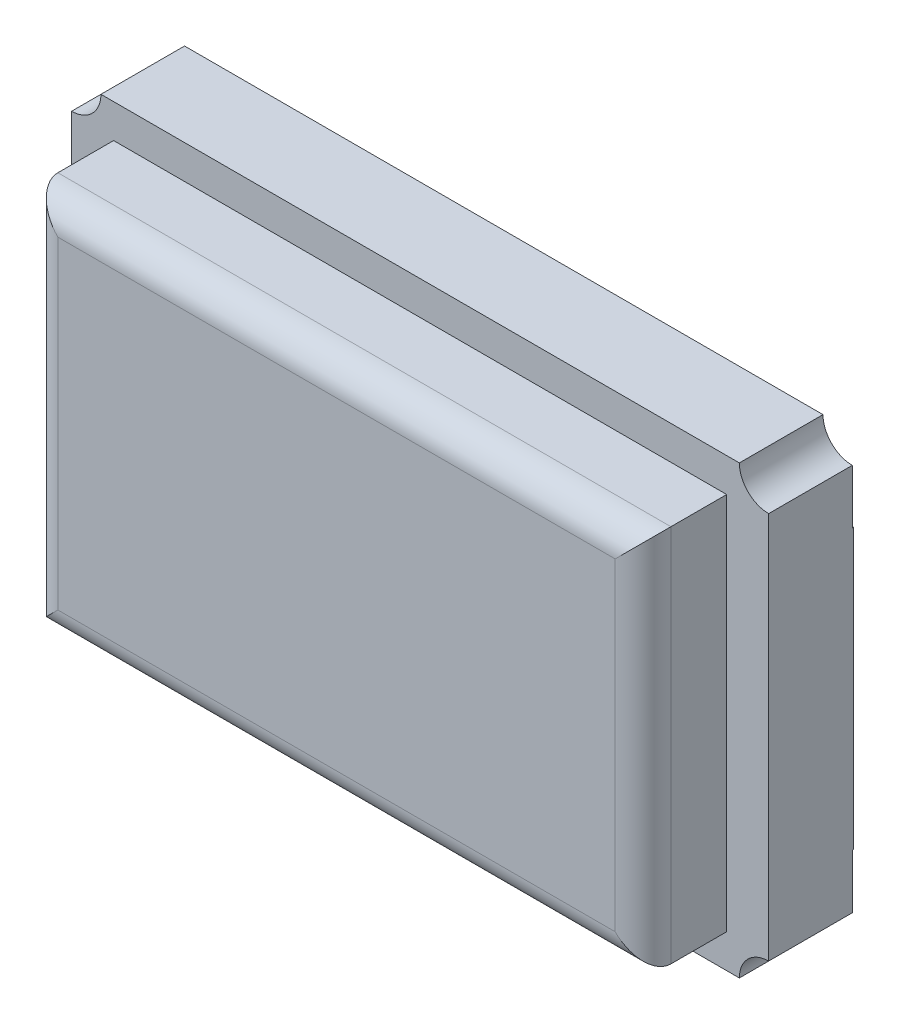
ISO-10303-21;
HEADER;
FILE_DESCRIPTION(('STEP AP214'),'2;1');
FILE_NAME('part.step','',(''),(''),'','','');
FILE_SCHEMA(('AUTOMOTIVE_DESIGN { 1 0 10303 214 1 1 1 1 }'));
ENDSEC;
DATA;
#1=APPLICATION_CONTEXT('core data for automotive mechanical design processes');
#2=APPLICATION_PROTOCOL_DEFINITION('international standard','automotive_design',2000,#1);
#3=PRODUCT_CONTEXT('',#1,'mechanical');
#4=PRODUCT('Part','Part','',(#3));
#5=PRODUCT_RELATED_PRODUCT_CATEGORY('part','',(#4));
#6=PRODUCT_DEFINITION_FORMATION('','',#4);
#7=PRODUCT_DEFINITION_CONTEXT('part definition',#1,'design');
#8=PRODUCT_DEFINITION('design','',#6,#7);
#9=PRODUCT_DEFINITION_SHAPE('','',#8);
#10=(LENGTH_UNIT() NAMED_UNIT(*) SI_UNIT(.MILLI.,.METRE.));
#11=(NAMED_UNIT(*) PLANE_ANGLE_UNIT() SI_UNIT($,.RADIAN.));
#12=(NAMED_UNIT(*) SI_UNIT($,.STERADIAN.) SOLID_ANGLE_UNIT());
#13=UNCERTAINTY_MEASURE_WITH_UNIT(LENGTH_MEASURE(1.E-05),#10,'distance_accuracy_value','');
#14=(GEOMETRIC_REPRESENTATION_CONTEXT(3) GLOBAL_UNCERTAINTY_ASSIGNED_CONTEXT((#13)) GLOBAL_UNIT_ASSIGNED_CONTEXT((#10,
#11,#12)) REPRESENTATION_CONTEXT('',''));
#15=CARTESIAN_POINT('',(0.,0.,0.));
#16=DIRECTION('',(0.,0.,1.));
#17=DIRECTION('',(1.,0.,0.));
#18=AXIS2_PLACEMENT_3D('',#15,#16,#17);
#19=CARTESIAN_POINT('',(-2.5,1.6,0.));
#20=DIRECTION('',(0.,0.,1.));
#21=DIRECTION('',(1.,0.,0.));
#22=AXIS2_PLACEMENT_3D('',#19,#20,#21);
#23=PLANE('',#22);
#24=DIRECTION('',(1.,0.,0.));
#25=VECTOR('',#24,1.);
#26=CARTESIAN_POINT('',(-2.5,0.999999999999999,0.));
#27=LINE('',#26,#25);
#28=CARTESIAN_POINT('',(-2.5,0.999999999999999,0.));
#29=VERTEX_POINT('',#28);
#30=CARTESIAN_POINT('',(-1.4,1.,0.));
#31=VERTEX_POINT('',#30);
#32=EDGE_CURVE('E216',#29,#31,#27,.T.);
#33=ORIENTED_EDGE('',*,*,#32,.F.);
#34=DIRECTION('',(0.,-1.,0.));
#35=VECTOR('',#34,1.);
#36=CARTESIAN_POINT('',(-2.5,1.38992371218339,0.));
#37=LINE('',#36,#35);
#38=CARTESIAN_POINT('',(-2.5,1.38992371218339,0.));
#39=VERTEX_POINT('',#38);
#40=EDGE_CURVE('E326',#39,#29,#37,.T.);
#41=ORIENTED_EDGE('',*,*,#40,.F.);
#42=CARTESIAN_POINT('',(-2.5,1.6,0.));
#43=DIRECTION('',(0.,0.,-1.));
#44=DIRECTION('',(1.,0.,0.));
#45=AXIS2_PLACEMENT_3D('',#42,#43,#44);
#46=CIRCLE('',#45,0.21007628781661);
#47=CARTESIAN_POINT('',(-2.28992371218339,1.6,0.));
#48=VERTEX_POINT('',#47);
#49=EDGE_CURVE('E294',#48,#39,#46,.T.);
#50=ORIENTED_EDGE('',*,*,#49,.F.);
#51=DIRECTION('',(-1.,0.,0.));
#52=VECTOR('',#51,1.);
#53=CARTESIAN_POINT('',(-2.28992371218339,1.6,0.));
#54=LINE('',#53,#52);
#55=CARTESIAN_POINT('',(2.28992371218339,1.6,0.));
#56=VERTEX_POINT('',#55);
#57=EDGE_CURVE('E300',#56,#48,#54,.T.);
#58=ORIENTED_EDGE('',*,*,#57,.F.);
#59=CARTESIAN_POINT('',(2.5,1.6,0.));
#60=DIRECTION('',(0.,0.,-1.));
#61=DIRECTION('',(-1.,0.,0.));
#62=AXIS2_PLACEMENT_3D('',#59,#60,#61);
#63=CIRCLE('',#62,0.21007628781661);
#64=CARTESIAN_POINT('',(2.5,1.38992371218339,0.));
#65=VERTEX_POINT('',#64);
#66=EDGE_CURVE('E344',#65,#56,#63,.T.);
#67=ORIENTED_EDGE('',*,*,#66,.F.);
#68=DIRECTION('',(0.,1.,0.));
#69=VECTOR('',#68,1.);
#70=CARTESIAN_POINT('',(2.5,1.38992371218339,0.));
#71=LINE('',#70,#69);
#72=CARTESIAN_POINT('',(2.5,1.,0.));
#73=VERTEX_POINT('',#72);
#74=EDGE_CURVE('E339',#73,#65,#71,.T.);
#75=ORIENTED_EDGE('',*,*,#74,.F.);
#76=DIRECTION('',(1.,0.,0.));
#77=VECTOR('',#76,1.);
#78=CARTESIAN_POINT('',(2.5,1.,0.));
#79=LINE('',#78,#77);
#80=CARTESIAN_POINT('',(1.4,1.,0.));
#81=VERTEX_POINT('',#80);
#82=EDGE_CURVE('E235',#81,#73,#79,.T.);
#83=ORIENTED_EDGE('',*,*,#82,.F.);
#84=DIRECTION('',(0.,1.,0.));
#85=VECTOR('',#84,1.);
#86=CARTESIAN_POINT('',(1.4,1.,0.));
#87=LINE('',#86,#85);
#88=CARTESIAN_POINT('',(1.4,-1.,0.));
#89=VERTEX_POINT('',#88);
#90=EDGE_CURVE('E224',#89,#81,#87,.T.);
#91=ORIENTED_EDGE('',*,*,#90,.F.);
#92=DIRECTION('',(-1.,0.,0.));
#93=VECTOR('',#92,1.);
#94=CARTESIAN_POINT('',(2.5,-1.,0.));
#95=LINE('',#94,#93);
#96=CARTESIAN_POINT('',(2.5,-1.,0.));
#97=VERTEX_POINT('',#96);
#98=EDGE_CURVE('E219',#97,#89,#95,.T.);
#99=ORIENTED_EDGE('',*,*,#98,.F.);
#100=CARTESIAN_POINT('',(2.5,-1.38992371218339,0.));
#101=VERTEX_POINT('',#100);
#102=EDGE_CURVE('E340',#101,#97,#71,.T.);
#103=ORIENTED_EDGE('',*,*,#102,.F.);
#104=CARTESIAN_POINT('',(2.5,-1.6,0.));
#105=DIRECTION('',(0.,0.,-1.));
#106=DIRECTION('',(1.,0.,0.));
#107=AXIS2_PLACEMENT_3D('',#104,#105,#106);
#108=CIRCLE('',#107,0.210076287816611);
#109=CARTESIAN_POINT('',(2.28992371218339,-1.6,0.));
#110=VERTEX_POINT('',#109);
#111=EDGE_CURVE('E336',#110,#101,#108,.T.);
#112=ORIENTED_EDGE('',*,*,#111,.F.);
#113=DIRECTION('',(1.,0.,0.));
#114=VECTOR('',#113,1.);
#115=CARTESIAN_POINT('',(-2.28992371218339,-1.6,0.));
#116=LINE('',#115,#114);
#117=CARTESIAN_POINT('',(-2.28992371218339,-1.6,0.));
#118=VERTEX_POINT('',#117);
#119=EDGE_CURVE('E333',#118,#110,#116,.T.);
#120=ORIENTED_EDGE('',*,*,#119,.F.);
#121=CARTESIAN_POINT('',(-2.5,-1.6,0.));
#122=DIRECTION('',(0.,0.,-1.));
#123=DIRECTION('',(-1.,0.,0.));
#124=AXIS2_PLACEMENT_3D('',#121,#122,#123);
#125=CIRCLE('',#124,0.210076287816611);
#126=CARTESIAN_POINT('',(-2.5,-1.38992371218339,0.));
#127=VERTEX_POINT('',#126);
#128=EDGE_CURVE('E330',#127,#118,#125,.T.);
#129=ORIENTED_EDGE('',*,*,#128,.F.);
#130=CARTESIAN_POINT('',(-2.5,-1.,0.));
#131=VERTEX_POINT('',#130);
#132=EDGE_CURVE('E325',#131,#127,#37,.T.);
#133=ORIENTED_EDGE('',*,*,#132,.F.);
#134=DIRECTION('',(-1.,0.,0.));
#135=VECTOR('',#134,1.);
#136=CARTESIAN_POINT('',(-2.5,-1.,0.));
#137=LINE('',#136,#135);
#138=CARTESIAN_POINT('',(-1.4,-1.,0.));
#139=VERTEX_POINT('',#138);
#140=EDGE_CURVE('E212',#139,#131,#137,.T.);
#141=ORIENTED_EDGE('',*,*,#140,.F.);
#142=DIRECTION('',(0.,-1.,0.));
#143=VECTOR('',#142,1.);
#144=CARTESIAN_POINT('',(-1.4,1.,0.));
#145=LINE('',#144,#143);
#146=EDGE_CURVE('E419',#31,#139,#145,.T.);
#147=ORIENTED_EDGE('',*,*,#146,.F.);
#148=EDGE_LOOP('',(#33,#41,#50,#58,#67,#75,#83,#91,#99,#103,#112,#120,#129,#133,#141,#147));
#149=FACE_BOUND('',#148,.T.);
#150=ADVANCED_FACE('F41',(#149),#23,.F.);
#151=CARTESIAN_POINT('',(-2.5,1.6,0.6));
#152=DIRECTION('',(0.,0.,-1.));
#153=DIRECTION('',(-1.,0.,0.));
#154=AXIS2_PLACEMENT_3D('',#151,#152,#153);
#155=CYLINDRICAL_SURFACE('',#154,0.21007628781661);
#156=ORIENTED_EDGE('',*,*,#49,.T.);
#157=DIRECTION('',(0.,0.,-1.));
#158=VECTOR('',#157,1.);
#159=CARTESIAN_POINT('',(-2.5,1.38992371218339,0.6));
#160=LINE('',#159,#158);
#161=CARTESIAN_POINT('',(-2.5,1.38992371218339,0.6));
#162=VERTEX_POINT('',#161);
#163=EDGE_CURVE('E376',#162,#39,#160,.T.);
#164=ORIENTED_EDGE('',*,*,#163,.F.);
#165=CARTESIAN_POINT('',(-2.5,1.6,0.6));
#166=DIRECTION('',(0.,0.,-1.));
#167=DIRECTION('',(1.,0.,0.));
#168=AXIS2_PLACEMENT_3D('',#165,#166,#167);
#169=CIRCLE('',#168,0.21007628781661);
#170=CARTESIAN_POINT('',(-2.28992371218339,1.6,0.6));
#171=VERTEX_POINT('',#170);
#172=EDGE_CURVE('E295',#171,#162,#169,.T.);
#173=ORIENTED_EDGE('',*,*,#172,.F.);
#174=DIRECTION('',(0.,0.,-1.));
#175=VECTOR('',#174,1.);
#176=CARTESIAN_POINT('',(-2.28992371218339,1.6,0.6));
#177=LINE('',#176,#175);
#178=EDGE_CURVE('E321',#171,#48,#177,.T.);
#179=ORIENTED_EDGE('',*,*,#178,.T.);
#180=EDGE_LOOP('',(#156,#164,#173,#179));
#181=FACE_BOUND('',#180,.T.);
#182=ADVANCED_FACE('F464',(#181),#155,.F.);
#183=CARTESIAN_POINT('',(-2.5,1.38992371218339,0.6));
#184=DIRECTION('',(1.,0.,0.));
#185=DIRECTION('',(0.,0.,-1.));
#186=AXIS2_PLACEMENT_3D('',#183,#184,#185);
#187=PLANE('',#186);
#188=ORIENTED_EDGE('',*,*,#40,.T.);
#189=DIRECTION('',(0.,0.,1.));
#190=VECTOR('',#189,1.);
#191=CARTESIAN_POINT('',(-2.5,0.999999999999999,-0.01));
#192=LINE('',#191,#190);
#193=CARTESIAN_POINT('',(-2.5,0.999999999999999,-0.01));
#194=VERTEX_POINT('',#193);
#195=EDGE_CURVE('E429',#194,#29,#192,.T.);
#196=ORIENTED_EDGE('',*,*,#195,.F.);
#197=DIRECTION('',(0.,1.,0.));
#198=VECTOR('',#197,1.);
#199=CARTESIAN_POINT('',(-2.5,0.999999999999999,-0.01));
#200=LINE('',#199,#198);
#201=CARTESIAN_POINT('',(-2.5,-1.,-0.01));
#202=VERTEX_POINT('',#201);
#203=EDGE_CURVE('E208',#202,#194,#200,.T.);
#204=ORIENTED_EDGE('',*,*,#203,.F.);
#205=DIRECTION('',(0.,0.,1.));
#206=VECTOR('',#205,1.);
#207=CARTESIAN_POINT('',(-2.5,-1.,-0.01));
#208=LINE('',#207,#206);
#209=EDGE_CURVE('E226',#202,#131,#208,.T.);
#210=ORIENTED_EDGE('',*,*,#209,.T.);
#211=ORIENTED_EDGE('',*,*,#132,.T.);
#212=DIRECTION('',(0.,0.,-1.));
#213=VECTOR('',#212,1.);
#214=CARTESIAN_POINT('',(-2.5,-1.38992371218339,0.6));
#215=LINE('',#214,#213);
#216=CARTESIAN_POINT('',(-2.5,-1.38992371218339,0.6));
#217=VERTEX_POINT('',#216);
#218=EDGE_CURVE('E372',#217,#127,#215,.T.);
#219=ORIENTED_EDGE('',*,*,#218,.F.);
#220=DIRECTION('',(0.,-1.,0.));
#221=VECTOR('',#220,1.);
#222=CARTESIAN_POINT('',(-2.5,1.38992371218339,0.6));
#223=LINE('',#222,#221);
#224=EDGE_CURVE('E299',#162,#217,#223,.T.);
#225=ORIENTED_EDGE('',*,*,#224,.F.);
#226=ORIENTED_EDGE('',*,*,#163,.T.);
#227=EDGE_LOOP('',(#188,#196,#204,#210,#211,#219,#225,#226));
#228=FACE_BOUND('',#227,.T.);
#229=ADVANCED_FACE('F434',(#228),#187,.F.);
#230=CARTESIAN_POINT('',(-2.5,-1.6,0.6));
#231=DIRECTION('',(0.,0.,-1.));
#232=DIRECTION('',(-1.,0.,0.));
#233=AXIS2_PLACEMENT_3D('',#230,#231,#232);
#234=CYLINDRICAL_SURFACE('',#233,0.210076287816611);
#235=ORIENTED_EDGE('',*,*,#128,.T.);
#236=DIRECTION('',(0.,0.,-1.));
#237=VECTOR('',#236,1.);
#238=CARTESIAN_POINT('',(-2.28992371218339,-1.6,0.6));
#239=LINE('',#238,#237);
#240=CARTESIAN_POINT('',(-2.28992371218339,-1.6,0.6));
#241=VERTEX_POINT('',#240);
#242=EDGE_CURVE('E368',#241,#118,#239,.T.);
#243=ORIENTED_EDGE('',*,*,#242,.F.);
#244=CARTESIAN_POINT('',(-2.5,-1.6,0.6));
#245=DIRECTION('',(0.,0.,-1.));
#246=DIRECTION('',(-1.,0.,0.));
#247=AXIS2_PLACEMENT_3D('',#244,#245,#246);
#248=CIRCLE('',#247,0.210076287816611);
#249=EDGE_CURVE('E303',#217,#241,#248,.T.);
#250=ORIENTED_EDGE('',*,*,#249,.F.);
#251=ORIENTED_EDGE('',*,*,#218,.T.);
#252=EDGE_LOOP('',(#235,#243,#250,#251));
#253=FACE_BOUND('',#252,.T.);
#254=ADVANCED_FACE('F515',(#253),#234,.F.);
#255=CARTESIAN_POINT('',(-2.28992371218339,-1.6,0.6));
#256=DIRECTION('',(0.,1.,0.));
#257=DIRECTION('',(0.,0.,1.));
#258=AXIS2_PLACEMENT_3D('',#255,#256,#257);
#259=PLANE('',#258);
#260=ORIENTED_EDGE('',*,*,#119,.T.);
#261=DIRECTION('',(0.,0.,-1.));
#262=VECTOR('',#261,1.);
#263=CARTESIAN_POINT('',(2.28992371218339,-1.6,0.6));
#264=LINE('',#263,#262);
#265=CARTESIAN_POINT('',(2.28992371218339,-1.6,0.6));
#266=VERTEX_POINT('',#265);
#267=EDGE_CURVE('E364',#266,#110,#264,.T.);
#268=ORIENTED_EDGE('',*,*,#267,.F.);
#269=DIRECTION('',(1.,0.,0.));
#270=VECTOR('',#269,1.);
#271=CARTESIAN_POINT('',(-2.28992371218339,-1.6,0.6));
#272=LINE('',#271,#270);
#273=EDGE_CURVE('E306',#241,#266,#272,.T.);
#274=ORIENTED_EDGE('',*,*,#273,.F.);
#275=ORIENTED_EDGE('',*,*,#242,.T.);
#276=EDGE_LOOP('',(#260,#268,#274,#275));
#277=FACE_BOUND('',#276,.T.);
#278=ADVANCED_FACE('F512',(#277),#259,.F.);
#279=CARTESIAN_POINT('',(2.5,-1.6,0.6));
#280=DIRECTION('',(0.,0.,-1.));
#281=DIRECTION('',(-1.,0.,0.));
#282=AXIS2_PLACEMENT_3D('',#279,#280,#281);
#283=CYLINDRICAL_SURFACE('',#282,0.210076287816611);
#284=ORIENTED_EDGE('',*,*,#111,.T.);
#285=DIRECTION('',(0.,0.,-1.));
#286=VECTOR('',#285,1.);
#287=CARTESIAN_POINT('',(2.5,-1.38992371218339,0.6));
#288=LINE('',#287,#286);
#289=CARTESIAN_POINT('',(2.5,-1.38992371218339,0.6));
#290=VERTEX_POINT('',#289);
#291=EDGE_CURVE('E360',#290,#101,#288,.T.);
#292=ORIENTED_EDGE('',*,*,#291,.F.);
#293=CARTESIAN_POINT('',(2.5,-1.6,0.6));
#294=DIRECTION('',(0.,0.,-1.));
#295=DIRECTION('',(1.,0.,0.));
#296=AXIS2_PLACEMENT_3D('',#293,#294,#295);
#297=CIRCLE('',#296,0.210076287816611);
#298=EDGE_CURVE('E309',#266,#290,#297,.T.);
#299=ORIENTED_EDGE('',*,*,#298,.F.);
#300=ORIENTED_EDGE('',*,*,#267,.T.);
#301=EDGE_LOOP('',(#284,#292,#299,#300));
#302=FACE_BOUND('',#301,.T.);
#303=ADVANCED_FACE('F509',(#302),#283,.F.);
#304=CARTESIAN_POINT('',(2.5,1.38992371218339,0.6));
#305=DIRECTION('',(-1.,0.,0.));
#306=DIRECTION('',(0.,0.,1.));
#307=AXIS2_PLACEMENT_3D('',#304,#305,#306);
#308=PLANE('',#307);
#309=ORIENTED_EDGE('',*,*,#102,.T.);
#310=DIRECTION('',(0.,0.,1.));
#311=VECTOR('',#310,1.);
#312=CARTESIAN_POINT('',(2.5,-1.,-0.01));
#313=LINE('',#312,#311);
#314=CARTESIAN_POINT('',(2.5,-1.,-0.01));
#315=VERTEX_POINT('',#314);
#316=EDGE_CURVE('E262',#315,#97,#313,.T.);
#317=ORIENTED_EDGE('',*,*,#316,.F.);
#318=DIRECTION('',(0.,-1.,0.));
#319=VECTOR('',#318,1.);
#320=CARTESIAN_POINT('',(2.5,1.,-0.01));
#321=LINE('',#320,#319);
#322=CARTESIAN_POINT('',(2.5,1.,-0.01));
#323=VERTEX_POINT('',#322);
#324=EDGE_CURVE('E230',#323,#315,#321,.T.);
#325=ORIENTED_EDGE('',*,*,#324,.F.);
#326=DIRECTION('',(0.,0.,1.));
#327=VECTOR('',#326,1.);
#328=CARTESIAN_POINT('',(2.5,1.,-0.01));
#329=LINE('',#328,#327);
#330=EDGE_CURVE('E243',#323,#73,#329,.T.);
#331=ORIENTED_EDGE('',*,*,#330,.T.);
#332=ORIENTED_EDGE('',*,*,#74,.T.);
#333=DIRECTION('',(0.,0.,-1.));
#334=VECTOR('',#333,1.);
#335=CARTESIAN_POINT('',(2.5,1.38992371218339,0.6));
#336=LINE('',#335,#334);
#337=CARTESIAN_POINT('',(2.5,1.38992371218339,0.6));
#338=VERTEX_POINT('',#337);
#339=EDGE_CURVE('E356',#338,#65,#336,.T.);
#340=ORIENTED_EDGE('',*,*,#339,.F.);
#341=DIRECTION('',(0.,1.,0.));
#342=VECTOR('',#341,1.);
#343=CARTESIAN_POINT('',(2.5,1.38992371218339,0.6));
#344=LINE('',#343,#342);
#345=EDGE_CURVE('E312',#290,#338,#344,.T.);
#346=ORIENTED_EDGE('',*,*,#345,.F.);
#347=ORIENTED_EDGE('',*,*,#291,.T.);
#348=EDGE_LOOP('',(#309,#317,#325,#331,#332,#340,#346,#347));
#349=FACE_BOUND('',#348,.T.);
#350=ADVANCED_FACE('F447',(#349),#308,.F.);
#351=CARTESIAN_POINT('',(2.5,1.6,0.6));
#352=DIRECTION('',(0.,0.,-1.));
#353=DIRECTION('',(-1.,0.,0.));
#354=AXIS2_PLACEMENT_3D('',#351,#352,#353);
#355=CYLINDRICAL_SURFACE('',#354,0.21007628781661);
#356=ORIENTED_EDGE('',*,*,#66,.T.);
#357=DIRECTION('',(0.,0.,-1.));
#358=VECTOR('',#357,1.);
#359=CARTESIAN_POINT('',(2.28992371218339,1.6,0.6));
#360=LINE('',#359,#358);
#361=CARTESIAN_POINT('',(2.28992371218339,1.6,0.6));
#362=VERTEX_POINT('',#361);
#363=EDGE_CURVE('E352',#362,#56,#360,.T.);
#364=ORIENTED_EDGE('',*,*,#363,.F.);
#365=CARTESIAN_POINT('',(2.5,1.6,0.6));
#366=DIRECTION('',(0.,0.,-1.));
#367=DIRECTION('',(-1.,0.,0.));
#368=AXIS2_PLACEMENT_3D('',#365,#366,#367);
#369=CIRCLE('',#368,0.21007628781661);
#370=EDGE_CURVE('E315',#338,#362,#369,.T.);
#371=ORIENTED_EDGE('',*,*,#370,.F.);
#372=ORIENTED_EDGE('',*,*,#339,.T.);
#373=EDGE_LOOP('',(#356,#364,#371,#372));
#374=FACE_BOUND('',#373,.T.);
#375=ADVANCED_FACE('F454',(#374),#355,.F.);
#376=CARTESIAN_POINT('',(-2.28992371218339,1.6,0.6));
#377=DIRECTION('',(0.,-1.,0.));
#378=DIRECTION('',(0.,0.,-1.));
#379=AXIS2_PLACEMENT_3D('',#376,#377,#378);
#380=PLANE('',#379);
#381=ORIENTED_EDGE('',*,*,#57,.T.);
#382=ORIENTED_EDGE('',*,*,#178,.F.);
#383=DIRECTION('',(-1.,0.,0.));
#384=VECTOR('',#383,1.);
#385=CARTESIAN_POINT('',(-2.28992371218339,1.6,0.6));
#386=LINE('',#385,#384);
#387=EDGE_CURVE('E318',#362,#171,#386,.T.);
#388=ORIENTED_EDGE('',*,*,#387,.F.);
#389=ORIENTED_EDGE('',*,*,#363,.T.);
#390=EDGE_LOOP('',(#381,#382,#388,#389));
#391=FACE_BOUND('',#390,.T.);
#392=ADVANCED_FACE('F460',(#391),#380,.F.);
#393=CARTESIAN_POINT('',(-2.5,1.6,0.6));
#394=DIRECTION('',(0.,0.,1.));
#395=DIRECTION('',(1.,0.,0.));
#396=AXIS2_PLACEMENT_3D('',#393,#394,#395);
#397=PLANE('',#396);
#398=DIRECTION('',(0.,1.,0.));
#399=VECTOR('',#398,1.);
#400=CARTESIAN_POINT('',(2.19887803247018,1.35813054946688,0.6));
#401=LINE('',#400,#399);
#402=CARTESIAN_POINT('',(2.19887803247018,-1.35813054946688,0.6));
#403=VERTEX_POINT('',#402);
#404=CARTESIAN_POINT('',(2.19887803247018,1.35813054946688,0.6));
#405=VERTEX_POINT('',#404);
#406=EDGE_CURVE('E266',#403,#405,#401,.T.);
#407=ORIENTED_EDGE('',*,*,#406,.F.);
#408=DIRECTION('',(1.,0.,0.));
#409=VECTOR('',#408,1.);
#410=CARTESIAN_POINT('',(-2.19887803247018,-1.35813054946688,0.6));
#411=LINE('',#410,#409);
#412=CARTESIAN_POINT('',(-2.19887803247018,-1.35813054946688,0.6));
#413=VERTEX_POINT('',#412);
#414=EDGE_CURVE('E278',#413,#403,#411,.T.);
#415=ORIENTED_EDGE('',*,*,#414,.F.);
#416=DIRECTION('',(0.,-1.,0.));
#417=VECTOR('',#416,1.);
#418=CARTESIAN_POINT('',(-2.19887803247018,1.35813054946688,0.6));
#419=LINE('',#418,#417);
#420=CARTESIAN_POINT('',(-2.19887803247018,1.35813054946688,0.6));
#421=VERTEX_POINT('',#420);
#422=EDGE_CURVE('E274',#421,#413,#419,.T.);
#423=ORIENTED_EDGE('',*,*,#422,.F.);
#424=DIRECTION('',(-1.,0.,0.));
#425=VECTOR('',#424,1.);
#426=CARTESIAN_POINT('',(-2.19887803247018,1.35813054946688,0.6));
#427=LINE('',#426,#425);
#428=EDGE_CURVE('E270',#405,#421,#427,.T.);
#429=ORIENTED_EDGE('',*,*,#428,.F.);
#430=EDGE_LOOP('',(#407,#415,#423,#429));
#431=FACE_BOUND('',#430,.T.);
#432=ORIENTED_EDGE('',*,*,#172,.T.);
#433=ORIENTED_EDGE('',*,*,#224,.T.);
#434=ORIENTED_EDGE('',*,*,#249,.T.);
#435=ORIENTED_EDGE('',*,*,#273,.T.);
#436=ORIENTED_EDGE('',*,*,#298,.T.);
#437=ORIENTED_EDGE('',*,*,#345,.T.);
#438=ORIENTED_EDGE('',*,*,#370,.T.);
#439=ORIENTED_EDGE('',*,*,#387,.T.);
#440=EDGE_LOOP('',(#432,#433,#434,#435,#436,#437,#438,#439));
#441=FACE_BOUND('',#440,.T.);
#442=ADVANCED_FACE('F467',(#431,#441),#397,.T.);
#443=CARTESIAN_POINT('',(2.19887803247018,1.35813054946688,1.2));
#444=DIRECTION('',(-1.,0.,0.));
#445=DIRECTION('',(0.,0.,1.));
#446=AXIS2_PLACEMENT_3D('',#443,#444,#445);
#447=PLANE('',#446);
#448=DIRECTION('',(0.,0.,-1.));
#449=VECTOR('',#448,1.);
#450=CARTESIAN_POINT('',(2.19887803247018,1.35813054946688,1.2));
#451=LINE('',#450,#449);
#452=CARTESIAN_POINT('',(2.19887803247018,1.35813054946688,1.));
#453=VERTEX_POINT('',#452);
#454=EDGE_CURVE('E291',#453,#405,#451,.T.);
#455=ORIENTED_EDGE('',*,*,#454,.F.);
#456=DIRECTION('',(0.,1.,0.));
#457=VECTOR('',#456,1.);
#458=CARTESIAN_POINT('',(2.19887803247018,-1.35813054946688,1.));
#459=LINE('',#458,#457);
#460=CARTESIAN_POINT('',(2.19887803247018,-1.35813054946688,1.));
#461=VERTEX_POINT('',#460);
#462=EDGE_CURVE('E11',#453,#461,#459,.F.);
#463=ORIENTED_EDGE('',*,*,#462,.T.);
#464=DIRECTION('',(0.,0.,-1.));
#465=VECTOR('',#464,1.);
#466=CARTESIAN_POINT('',(2.19887803247018,-1.35813054946688,1.2));
#467=LINE('',#466,#465);
#468=EDGE_CURVE('E282',#461,#403,#467,.T.);
#469=ORIENTED_EDGE('',*,*,#468,.T.);
#470=ORIENTED_EDGE('',*,*,#406,.T.);
#471=EDGE_LOOP('',(#455,#463,#469,#470));
#472=FACE_BOUND('',#471,.T.);
#473=ADVANCED_FACE('F542',(#472),#447,.F.);
#474=CARTESIAN_POINT('',(-2.19887803247018,1.35813054946688,1.2));
#475=DIRECTION('',(0.,-1.,0.));
#476=DIRECTION('',(0.,0.,-1.));
#477=AXIS2_PLACEMENT_3D('',#474,#475,#476);
#478=PLANE('',#477);
#479=DIRECTION('',(0.,0.,-1.));
#480=VECTOR('',#479,1.);
#481=CARTESIAN_POINT('',(-2.19887803247018,1.35813054946688,1.2));
#482=LINE('',#481,#480);
#483=CARTESIAN_POINT('',(-2.19887803247018,1.35813054946688,1.));
#484=VERTEX_POINT('',#483);
#485=EDGE_CURVE('E288',#484,#421,#482,.T.);
#486=ORIENTED_EDGE('',*,*,#485,.F.);
#487=DIRECTION('',(-1.,0.,0.));
#488=VECTOR('',#487,1.);
#489=CARTESIAN_POINT('',(2.19887803247018,1.35813054946688,1.));
#490=LINE('',#489,#488);
#491=EDGE_CURVE('E51',#484,#453,#490,.F.);
#492=ORIENTED_EDGE('',*,*,#491,.T.);
#493=ORIENTED_EDGE('',*,*,#454,.T.);
#494=ORIENTED_EDGE('',*,*,#428,.T.);
#495=EDGE_LOOP('',(#486,#492,#493,#494));
#496=FACE_BOUND('',#495,.T.);
#497=ADVANCED_FACE('F564',(#496),#478,.F.);
#498=CARTESIAN_POINT('',(-2.19887803247018,1.35813054946688,1.2));
#499=DIRECTION('',(1.,0.,0.));
#500=DIRECTION('',(0.,0.,-1.));
#501=AXIS2_PLACEMENT_3D('',#498,#499,#500);
#502=PLANE('',#501);
#503=DIRECTION('',(0.,0.,-1.));
#504=VECTOR('',#503,1.);
#505=CARTESIAN_POINT('',(-2.19887803247018,-1.35813054946688,1.2));
#506=LINE('',#505,#504);
#507=CARTESIAN_POINT('',(-2.19887803247018,-1.35813054946688,1.));
#508=VERTEX_POINT('',#507);
#509=EDGE_CURVE('E285',#508,#413,#506,.T.);
#510=ORIENTED_EDGE('',*,*,#509,.F.);
#511=DIRECTION('',(0.,-1.,0.));
#512=VECTOR('',#511,1.);
#513=CARTESIAN_POINT('',(-2.19887803247018,1.35813054946688,1.));
#514=LINE('',#513,#512);
#515=EDGE_CURVE('E66',#508,#484,#514,.F.);
#516=ORIENTED_EDGE('',*,*,#515,.T.);
#517=ORIENTED_EDGE('',*,*,#485,.T.);
#518=ORIENTED_EDGE('',*,*,#422,.T.);
#519=EDGE_LOOP('',(#510,#516,#517,#518));
#520=FACE_BOUND('',#519,.T.);
#521=ADVANCED_FACE('F559',(#520),#502,.F.);
#522=CARTESIAN_POINT('',(-2.19887803247018,-1.35813054946688,1.2));
#523=DIRECTION('',(0.,1.,0.));
#524=DIRECTION('',(0.,0.,1.));
#525=AXIS2_PLACEMENT_3D('',#522,#523,#524);
#526=PLANE('',#525);
#527=ORIENTED_EDGE('',*,*,#468,.F.);
#528=DIRECTION('',(1.,0.,0.));
#529=VECTOR('',#528,1.);
#530=CARTESIAN_POINT('',(-2.19887803247018,-1.35813054946688,1.));
#531=LINE('',#530,#529);
#532=EDGE_CURVE('E393',#461,#508,#531,.F.);
#533=ORIENTED_EDGE('',*,*,#532,.T.);
#534=ORIENTED_EDGE('',*,*,#509,.T.);
#535=ORIENTED_EDGE('',*,*,#414,.T.);
#536=EDGE_LOOP('',(#527,#533,#534,#535));
#537=FACE_BOUND('',#536,.T.);
#538=ADVANCED_FACE('F546',(#537),#526,.F.);
#539=CARTESIAN_POINT('',(0.,0.,1.2));
#540=DIRECTION('',(0.,0.,1.));
#541=DIRECTION('',(1.,0.,0.));
#542=AXIS2_PLACEMENT_3D('',#539,#540,#541);
#543=PLANE('',#542);
#544=DIRECTION('',(0.,-1.,0.));
#545=VECTOR('',#544,1.);
#546=CARTESIAN_POINT('',(-1.99887803247018,-1.35813054946688,1.2));
#547=LINE('',#546,#545);
#548=CARTESIAN_POINT('',(-1.99887803247018,1.15813054946687,1.2));
#549=VERTEX_POINT('',#548);
#550=CARTESIAN_POINT('',(-1.99887803247018,-1.15813054946687,1.2));
#551=VERTEX_POINT('',#550);
#552=EDGE_CURVE('E386',#549,#551,#547,.T.);
#553=ORIENTED_EDGE('',*,*,#552,.T.);
#554=DIRECTION('',(1.,0.,0.));
#555=VECTOR('',#554,1.);
#556=CARTESIAN_POINT('',(2.19887803247018,-1.15813054946687,1.2));
#557=LINE('',#556,#555);
#558=CARTESIAN_POINT('',(1.99887803247018,-1.15813054946687,1.2));
#559=VERTEX_POINT('',#558);
#560=EDGE_CURVE('E389',#551,#559,#557,.T.);
#561=ORIENTED_EDGE('',*,*,#560,.T.);
#562=DIRECTION('',(0.,1.,0.));
#563=VECTOR('',#562,1.);
#564=CARTESIAN_POINT('',(1.99887803247018,1.35813054946688,1.2));
#565=LINE('',#564,#563);
#566=CARTESIAN_POINT('',(1.99887803247018,1.15813054946687,1.2));
#567=VERTEX_POINT('',#566);
#568=EDGE_CURVE('E380',#559,#567,#565,.T.);
#569=ORIENTED_EDGE('',*,*,#568,.T.);
#570=DIRECTION('',(-1.,0.,0.));
#571=VECTOR('',#570,1.);
#572=CARTESIAN_POINT('',(-2.19887803247018,1.15813054946687,1.2));
#573=LINE('',#572,#571);
#574=EDGE_CURVE('E383',#567,#549,#573,.T.);
#575=ORIENTED_EDGE('',*,*,#574,.T.);
#576=EDGE_LOOP('',(#553,#561,#569,#575));
#577=FACE_BOUND('',#576,.T.);
#578=ADVANCED_FACE('F551',(#577),#543,.T.);
#579=CARTESIAN_POINT('',(2.5,-1.,-0.01));
#580=DIRECTION('',(0.,1.,0.));
#581=DIRECTION('',(-1.,0.,0.));
#582=AXIS2_PLACEMENT_3D('',#579,#580,#581);
#583=PLANE('',#582);
#584=ORIENTED_EDGE('',*,*,#98,.T.);
#585=DIRECTION('',(0.,0.,1.));
#586=VECTOR('',#585,1.);
#587=CARTESIAN_POINT('',(1.4,-1.,-0.01));
#588=LINE('',#587,#586);
#589=CARTESIAN_POINT('',(1.4,-1.,-0.01));
#590=VERTEX_POINT('',#589);
#591=EDGE_CURVE('E258',#590,#89,#588,.T.);
#592=ORIENTED_EDGE('',*,*,#591,.F.);
#593=DIRECTION('',(-1.,0.,0.));
#594=VECTOR('',#593,1.);
#595=CARTESIAN_POINT('',(2.5,-1.,-0.01));
#596=LINE('',#595,#594);
#597=EDGE_CURVE('E234',#315,#590,#596,.T.);
#598=ORIENTED_EDGE('',*,*,#597,.F.);
#599=ORIENTED_EDGE('',*,*,#316,.T.);
#600=EDGE_LOOP('',(#584,#592,#598,#599));
#601=FACE_BOUND('',#600,.T.);
#602=ADVANCED_FACE('F476',(#601),#583,.F.);
#603=CARTESIAN_POINT('',(1.4,1.,-0.01));
#604=DIRECTION('',(1.,0.,0.));
#605=DIRECTION('',(0.,0.,-1.));
#606=AXIS2_PLACEMENT_3D('',#603,#604,#605);
#607=PLANE('',#606);
#608=ORIENTED_EDGE('',*,*,#90,.T.);
#609=DIRECTION('',(0.,0.,1.));
#610=VECTOR('',#609,1.);
#611=CARTESIAN_POINT('',(1.4,1.,-0.01));
#612=LINE('',#611,#610);
#613=CARTESIAN_POINT('',(1.4,1.,-0.01));
#614=VERTEX_POINT('',#613);
#615=EDGE_CURVE('E254',#614,#81,#612,.T.);
#616=ORIENTED_EDGE('',*,*,#615,.F.);
#617=DIRECTION('',(0.,1.,0.));
#618=VECTOR('',#617,1.);
#619=CARTESIAN_POINT('',(1.4,1.,-0.01));
#620=LINE('',#619,#618);
#621=EDGE_CURVE('E238',#590,#614,#620,.T.);
#622=ORIENTED_EDGE('',*,*,#621,.F.);
#623=ORIENTED_EDGE('',*,*,#591,.T.);
#624=EDGE_LOOP('',(#608,#616,#622,#623));
#625=FACE_BOUND('',#624,.T.);
#626=ADVANCED_FACE('F479',(#625),#607,.F.);
#627=CARTESIAN_POINT('',(2.5,1.,-0.01));
#628=DIRECTION('',(0.,-1.,0.));
#629=DIRECTION('',(1.,0.,0.));
#630=AXIS2_PLACEMENT_3D('',#627,#628,#629);
#631=PLANE('',#630);
#632=ORIENTED_EDGE('',*,*,#82,.T.);
#633=ORIENTED_EDGE('',*,*,#330,.F.);
#634=DIRECTION('',(1.,0.,0.));
#635=VECTOR('',#634,1.);
#636=CARTESIAN_POINT('',(2.5,1.,-0.01));
#637=LINE('',#636,#635);
#638=EDGE_CURVE('E241',#614,#323,#637,.T.);
#639=ORIENTED_EDGE('',*,*,#638,.F.);
#640=ORIENTED_EDGE('',*,*,#615,.T.);
#641=EDGE_LOOP('',(#632,#633,#639,#640));
#642=FACE_BOUND('',#641,.T.);
#643=ADVANCED_FACE('F485',(#642),#631,.F.);
#644=CARTESIAN_POINT('',(0.,0.,-0.01));
#645=DIRECTION('',(0.,0.,-1.));
#646=DIRECTION('',(-1.,0.,0.));
#647=AXIS2_PLACEMENT_3D('',#644,#645,#646);
#648=PLANE('',#647);
#649=ORIENTED_EDGE('',*,*,#324,.T.);
#650=ORIENTED_EDGE('',*,*,#597,.T.);
#651=ORIENTED_EDGE('',*,*,#621,.T.);
#652=ORIENTED_EDGE('',*,*,#638,.T.);
#653=EDGE_LOOP('',(#649,#650,#651,#652));
#654=FACE_BOUND('',#653,.T.);
#655=ADVANCED_FACE('F483',(#654),#648,.T.);
#656=CARTESIAN_POINT('',(-2.5,0.999999999999999,-0.01));
#657=DIRECTION('',(0.,-1.,0.));
#658=DIRECTION('',(1.,0.,0.));
#659=AXIS2_PLACEMENT_3D('',#656,#657,#658);
#660=PLANE('',#659);
#661=ORIENTED_EDGE('',*,*,#32,.T.);
#662=DIRECTION('',(0.,0.,1.));
#663=VECTOR('',#662,1.);
#664=CARTESIAN_POINT('',(-1.4,1.,-0.01));
#665=LINE('',#664,#663);
#666=CARTESIAN_POINT('',(-1.4,1.,-0.01));
#667=VERTEX_POINT('',#666);
#668=EDGE_CURVE('E195',#667,#31,#665,.T.);
#669=ORIENTED_EDGE('',*,*,#668,.F.);
#670=DIRECTION('',(1.,0.,0.));
#671=VECTOR('',#670,1.);
#672=CARTESIAN_POINT('',(-2.5,0.999999999999999,-0.01));
#673=LINE('',#672,#671);
#674=EDGE_CURVE('E203',#194,#667,#673,.T.);
#675=ORIENTED_EDGE('',*,*,#674,.F.);
#676=ORIENTED_EDGE('',*,*,#195,.T.);
#677=EDGE_LOOP('',(#661,#669,#675,#676));
#678=FACE_BOUND('',#677,.T.);
#679=ADVANCED_FACE('F214',(#678),#660,.F.);
#680=CARTESIAN_POINT('',(-1.4,1.,-0.01));
#681=DIRECTION('',(-1.,0.,0.));
#682=DIRECTION('',(0.,-1.,0.));
#683=AXIS2_PLACEMENT_3D('',#680,#681,#682);
#684=PLANE('',#683);
#685=ORIENTED_EDGE('',*,*,#146,.T.);
#686=DIRECTION('',(0.,0.,1.));
#687=VECTOR('',#686,1.);
#688=CARTESIAN_POINT('',(-1.4,-1.,-0.01));
#689=LINE('',#688,#687);
#690=CARTESIAN_POINT('',(-1.4,-1.,-0.01));
#691=VERTEX_POINT('',#690);
#692=EDGE_CURVE('E198',#691,#139,#689,.T.);
#693=ORIENTED_EDGE('',*,*,#692,.F.);
#694=DIRECTION('',(0.,-1.,0.));
#695=VECTOR('',#694,1.);
#696=CARTESIAN_POINT('',(-1.4,1.,-0.01));
#697=LINE('',#696,#695);
#698=EDGE_CURVE('E191',#667,#691,#697,.T.);
#699=ORIENTED_EDGE('',*,*,#698,.F.);
#700=ORIENTED_EDGE('',*,*,#668,.T.);
#701=EDGE_LOOP('',(#685,#693,#699,#700));
#702=FACE_BOUND('',#701,.T.);
#703=ADVANCED_FACE('F193',(#702),#684,.F.);
#704=CARTESIAN_POINT('',(-2.5,-1.,-0.01));
#705=DIRECTION('',(0.,1.,0.));
#706=DIRECTION('',(-1.,0.,0.));
#707=AXIS2_PLACEMENT_3D('',#704,#705,#706);
#708=PLANE('',#707);
#709=ORIENTED_EDGE('',*,*,#140,.T.);
#710=ORIENTED_EDGE('',*,*,#209,.F.);
#711=DIRECTION('',(-1.,0.,0.));
#712=VECTOR('',#711,1.);
#713=CARTESIAN_POINT('',(-2.5,-1.,-0.01));
#714=LINE('',#713,#712);
#715=EDGE_CURVE('E202',#691,#202,#714,.T.);
#716=ORIENTED_EDGE('',*,*,#715,.F.);
#717=ORIENTED_EDGE('',*,*,#692,.T.);
#718=EDGE_LOOP('',(#709,#710,#716,#717));
#719=FACE_BOUND('',#718,.T.);
#720=ADVANCED_FACE('F439',(#719),#708,.F.);
#721=CARTESIAN_POINT('',(0.,0.,-0.01));
#722=DIRECTION('',(0.,0.,-1.));
#723=DIRECTION('',(-1.,0.,0.));
#724=AXIS2_PLACEMENT_3D('',#721,#722,#723);
#725=PLANE('',#724);
#726=ORIENTED_EDGE('',*,*,#674,.T.);
#727=ORIENTED_EDGE('',*,*,#698,.T.);
#728=ORIENTED_EDGE('',*,*,#715,.T.);
#729=ORIENTED_EDGE('',*,*,#203,.T.);
#730=EDGE_LOOP('',(#726,#727,#728,#729));
#731=FACE_BOUND('',#730,.T.);
#732=ADVANCED_FACE('F206',(#731),#725,.T.);
#733=CARTESIAN_POINT('',(0.,1.15813054946687,1.));
#734=DIRECTION('',(1.,0.,0.));
#735=DIRECTION('',(0.,0.,-1.));
#736=AXIS2_PLACEMENT_3D('',#733,#734,#735);
#737=CYLINDRICAL_SURFACE('',#736,0.2);
#738=CARTESIAN_POINT('',(1.99887803247018,1.15813054946687,1.));
#739=DIRECTION('',(0.707106781186547,-0.707106781186547,0.));
#740=DIRECTION('',(-0.707106781186547,-0.707106781186547,0.));
#741=AXIS2_PLACEMENT_3D('',#738,#739,#740);
#742=ELLIPSE('',#741,0.282842712474619,0.2);
#743=EDGE_CURVE('E406',#453,#567,#742,.T.);
#744=ORIENTED_EDGE('',*,*,#743,.F.);
#745=ORIENTED_EDGE('',*,*,#491,.F.);
#746=CARTESIAN_POINT('',(-1.99887803247018,1.15813054946687,1.));
#747=DIRECTION('',(0.707106781186547,0.707106781186547,0.));
#748=DIRECTION('',(0.707106781186547,-0.707106781186547,0.));
#749=AXIS2_PLACEMENT_3D('',#746,#747,#748);
#750=ELLIPSE('',#749,0.282842712474619,0.2);
#751=EDGE_CURVE('E45',#549,#484,#750,.F.);
#752=ORIENTED_EDGE('',*,*,#751,.F.);
#753=ORIENTED_EDGE('',*,*,#574,.F.);
#754=EDGE_LOOP('',(#744,#745,#752,#753));
#755=FACE_BOUND('',#754,.T.);
#756=ADVANCED_FACE('F43',(#755),#737,.T.);
#757=CARTESIAN_POINT('',(-1.99887803247018,0.,1.));
#758=DIRECTION('',(0.,1.,0.));
#759=DIRECTION('',(0.,0.,1.));
#760=AXIS2_PLACEMENT_3D('',#757,#758,#759);
#761=CYLINDRICAL_SURFACE('',#760,0.2);
#762=ORIENTED_EDGE('',*,*,#751,.T.);
#763=ORIENTED_EDGE('',*,*,#515,.F.);
#764=CARTESIAN_POINT('',(-1.99887803247018,-1.15813054946687,1.));
#765=DIRECTION('',(-0.707106781186547,0.707106781186547,0.));
#766=DIRECTION('',(0.707106781186547,0.707106781186547,0.));
#767=AXIS2_PLACEMENT_3D('',#764,#765,#766);
#768=ELLIPSE('',#767,0.282842712474619,0.2);
#769=EDGE_CURVE('E404',#551,#508,#768,.F.);
#770=ORIENTED_EDGE('',*,*,#769,.F.);
#771=ORIENTED_EDGE('',*,*,#552,.F.);
#772=EDGE_LOOP('',(#762,#763,#770,#771));
#773=FACE_BOUND('',#772,.T.);
#774=ADVANCED_FACE('F528',(#773),#761,.T.);
#775=CARTESIAN_POINT('',(1.99887803247018,0.,1.));
#776=DIRECTION('',(0.,-1.,0.));
#777=DIRECTION('',(0.,0.,-1.));
#778=AXIS2_PLACEMENT_3D('',#775,#776,#777);
#779=CYLINDRICAL_SURFACE('',#778,0.2);
#780=ORIENTED_EDGE('',*,*,#743,.T.);
#781=ORIENTED_EDGE('',*,*,#568,.F.);
#782=CARTESIAN_POINT('',(1.99887803247018,-1.15813054946687,1.));
#783=DIRECTION('',(-0.707106781186547,-0.707106781186547,0.));
#784=DIRECTION('',(0.707106781186547,-0.707106781186547,0.));
#785=AXIS2_PLACEMENT_3D('',#782,#783,#784);
#786=ELLIPSE('',#785,0.282842712474619,0.2);
#787=EDGE_CURVE('E401',#461,#559,#786,.T.);
#788=ORIENTED_EDGE('',*,*,#787,.F.);
#789=ORIENTED_EDGE('',*,*,#462,.F.);
#790=EDGE_LOOP('',(#780,#781,#788,#789));
#791=FACE_BOUND('',#790,.T.);
#792=ADVANCED_FACE('F525',(#791),#779,.T.);
#793=CARTESIAN_POINT('',(0.,-1.15813054946687,1.));
#794=DIRECTION('',(-1.,0.,0.));
#795=DIRECTION('',(0.,0.,1.));
#796=AXIS2_PLACEMENT_3D('',#793,#794,#795);
#797=CYLINDRICAL_SURFACE('',#796,0.2);
#798=ORIENTED_EDGE('',*,*,#769,.T.);
#799=ORIENTED_EDGE('',*,*,#532,.F.);
#800=ORIENTED_EDGE('',*,*,#787,.T.);
#801=ORIENTED_EDGE('',*,*,#560,.F.);
#802=EDGE_LOOP('',(#798,#799,#800,#801));
#803=FACE_BOUND('',#802,.T.);
#804=ADVANCED_FACE('F522',(#803),#797,.T.);
#805=CLOSED_SHELL('',(#150,#182,#229,#254,#278,#303,#350,#375,#392,#442,#473,#497,#521,#538,
#578,#602,#626,#643,#655,#679,#703,#720,#732,#756,#774,#792,#804));
#806=MANIFOLD_SOLID_BREP('B2',#805);
#807=ADVANCED_BREP_SHAPE_REPRESENTATION('',(#18,#806),#14);
#808=SHAPE_DEFINITION_REPRESENTATION(#9,#807);
ENDSEC;
END-ISO-10303-21;
